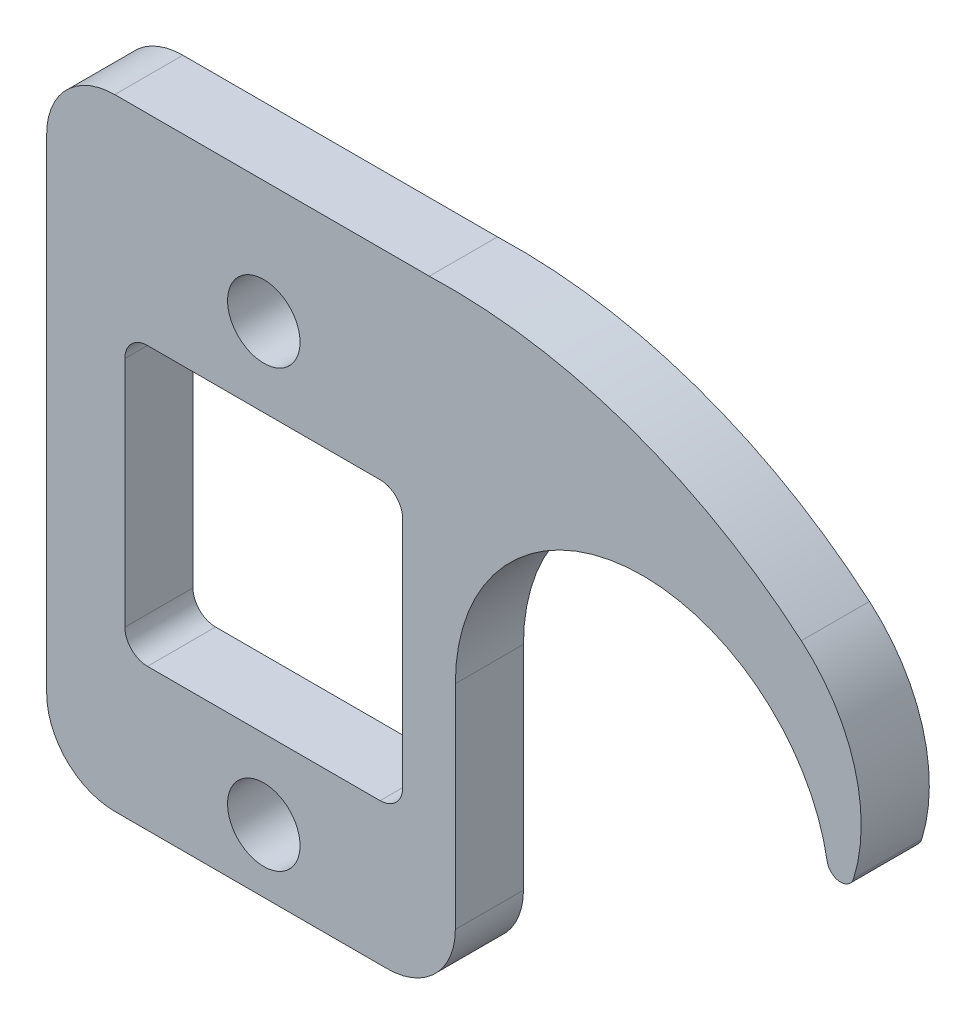
ISO-10303-21;
HEADER;
FILE_DESCRIPTION(('STEP AP214'),'2;1');
FILE_NAME('part.step','',(''),(''),'','','');
FILE_SCHEMA(('AUTOMOTIVE_DESIGN { 1 0 10303 214 1 1 1 1 }'));
ENDSEC;
DATA;
#1=APPLICATION_CONTEXT('core data for automotive mechanical design processes');
#2=APPLICATION_PROTOCOL_DEFINITION('international standard','automotive_design',2000,#1);
#3=PRODUCT_CONTEXT('',#1,'mechanical');
#4=PRODUCT('Part','Part','',(#3));
#5=PRODUCT_RELATED_PRODUCT_CATEGORY('part','',(#4));
#6=PRODUCT_DEFINITION_FORMATION('','',#4);
#7=PRODUCT_DEFINITION_CONTEXT('part definition',#1,'design');
#8=PRODUCT_DEFINITION('design','',#6,#7);
#9=PRODUCT_DEFINITION_SHAPE('','',#8);
#10=(LENGTH_UNIT() NAMED_UNIT(*) SI_UNIT(.MILLI.,.METRE.));
#11=(NAMED_UNIT(*) PLANE_ANGLE_UNIT() SI_UNIT($,.RADIAN.));
#12=(NAMED_UNIT(*) SI_UNIT($,.STERADIAN.) SOLID_ANGLE_UNIT());
#13=UNCERTAINTY_MEASURE_WITH_UNIT(LENGTH_MEASURE(1.E-05),#10,'distance_accuracy_value','');
#14=(GEOMETRIC_REPRESENTATION_CONTEXT(3) GLOBAL_UNCERTAINTY_ASSIGNED_CONTEXT((#13)) GLOBAL_UNIT_ASSIGNED_CONTEXT((#10,
#11,#12)) REPRESENTATION_CONTEXT('',''));
#15=CARTESIAN_POINT('',(0.,0.,0.));
#16=DIRECTION('',(0.,0.,1.));
#17=DIRECTION('',(1.,0.,0.));
#18=AXIS2_PLACEMENT_3D('',#15,#16,#17);
#19=CARTESIAN_POINT('',(-18.1389450946709,-19.0842207006165,3.175));
#20=DIRECTION('',(0.,0.,1.));
#21=DIRECTION('',(1.,0.,0.));
#22=AXIS2_PLACEMENT_3D('',#19,#20,#21);
#23=PLANE('',#22);
#24=CARTESIAN_POINT('',(-35.321875,-20.32,3.175));
#25=DIRECTION('',(0.,0.,1.));
#26=DIRECTION('',(1.,0.,0.));
#27=AXIS2_PLACEMENT_3D('',#24,#25,#26);
#28=CIRCLE('',#27,3.3782);
#29=CARTESIAN_POINT('',(-31.943675,-20.32,3.175));
#30=VERTEX_POINT('',#29);
#31=EDGE_CURVE('E234',#30,#30,#28,.T.);
#32=ORIENTED_EDGE('',*,*,#31,.F.);
#33=EDGE_LOOP('',(#32));
#34=FACE_BOUND('',#33,.T.);
#35=CARTESIAN_POINT('',(-18.1389450946709,-19.0842207006165,3.175));
#36=DIRECTION('',(0.,0.,1.));
#37=DIRECTION('',(1.,0.,0.));
#38=AXIS2_PLACEMENT_3D('',#35,#36,#37);
#39=CIRCLE('',#38,50.8);
#40=CARTESIAN_POINT('',(14.7930990556582,19.595495793701,3.175));
#41=VERTEX_POINT('',#40);
#42=CARTESIAN_POINT('',(-19.8857253584482,31.6857385145541,3.175));
#43=VERTEX_POINT('',#42);
#44=EDGE_CURVE('E240',#41,#43,#39,.T.);
#45=ORIENTED_EDGE('',*,*,#44,.T.);
#46=DIRECTION('',(-1.,0.,0.));
#47=VECTOR('',#46,1.);
#48=CARTESIAN_POINT('',(-19.8857253584482,31.6857385145541,3.175));
#49=LINE('',#48,#47);
#50=CARTESIAN_POINT('',(-49.2125,31.6857385145541,3.175));
#51=VERTEX_POINT('',#50);
#52=EDGE_CURVE('E243',#43,#51,#49,.T.);
#53=ORIENTED_EDGE('',*,*,#52,.T.);
#54=CARTESIAN_POINT('',(-49.2125,25.3357385145541,3.175));
#55=DIRECTION('',(0.,0.,1.));
#56=DIRECTION('',(1.,0.,0.));
#57=AXIS2_PLACEMENT_3D('',#54,#55,#56);
#58=CIRCLE('',#57,6.35);
#59=CARTESIAN_POINT('',(-55.5625,25.3357385145541,3.175));
#60=VERTEX_POINT('',#59);
#61=EDGE_CURVE('E246',#51,#60,#58,.T.);
#62=ORIENTED_EDGE('',*,*,#61,.T.);
#63=DIRECTION('',(0.,-1.,0.));
#64=VECTOR('',#63,1.);
#65=CARTESIAN_POINT('',(-55.5625,25.3357385145541,3.175));
#66=LINE('',#65,#64);
#67=CARTESIAN_POINT('',(-55.5625,-19.84375,3.175));
#68=VERTEX_POINT('',#67);
#69=EDGE_CURVE('E248',#60,#68,#66,.T.);
#70=ORIENTED_EDGE('',*,*,#69,.T.);
#71=CARTESIAN_POINT('',(-49.2125,-19.84375,3.175));
#72=DIRECTION('',(0.,0.,1.));
#73=DIRECTION('',(1.,0.,0.));
#74=AXIS2_PLACEMENT_3D('',#71,#72,#73);
#75=CIRCLE('',#74,6.35);
#76=CARTESIAN_POINT('',(-49.2125,-26.19375,3.175));
#77=VERTEX_POINT('',#76);
#78=EDGE_CURVE('E250',#68,#77,#75,.T.);
#79=ORIENTED_EDGE('',*,*,#78,.T.);
#80=DIRECTION('',(1.,0.,0.));
#81=VECTOR('',#80,1.);
#82=CARTESIAN_POINT('',(-49.2125,-26.19375,3.175));
#83=LINE('',#82,#81);
#84=CARTESIAN_POINT('',(-23.8125,-26.19375,3.175));
#85=VERTEX_POINT('',#84);
#86=EDGE_CURVE('E252',#77,#85,#83,.T.);
#87=ORIENTED_EDGE('',*,*,#86,.T.);
#88=CARTESIAN_POINT('',(-23.8125,-19.84375,3.175));
#89=DIRECTION('',(0.,0.,1.));
#90=DIRECTION('',(1.,0.,0.));
#91=AXIS2_PLACEMENT_3D('',#88,#89,#90);
#92=CIRCLE('',#91,6.35);
#93=CARTESIAN_POINT('',(-17.4625,-19.84375,3.175));
#94=VERTEX_POINT('',#93);
#95=EDGE_CURVE('E254',#85,#94,#92,.T.);
#96=ORIENTED_EDGE('',*,*,#95,.T.);
#97=DIRECTION('',(0.,1.,0.));
#98=VECTOR('',#97,1.);
#99=CARTESIAN_POINT('',(-17.4625,-19.84375,3.175));
#100=LINE('',#99,#98);
#101=CARTESIAN_POINT('',(-17.4625,-1.21864324187371E-13,3.175));
#102=VERTEX_POINT('',#101);
#103=EDGE_CURVE('E256',#94,#102,#100,.T.);
#104=ORIENTED_EDGE('',*,*,#103,.T.);
#105=CARTESIAN_POINT('',(0.,0.,3.175));
#106=DIRECTION('',(0.,0.,-1.));
#107=DIRECTION('',(1.,0.,0.));
#108=AXIS2_PLACEMENT_3D('',#105,#106,#107);
#109=CIRCLE('',#108,17.4625);
#110=CARTESIAN_POINT('',(17.205767985411,2.98336291493413,3.175));
#111=VERTEX_POINT('',#110);
#112=EDGE_CURVE('E258',#102,#111,#109,.T.);
#113=ORIENTED_EDGE('',*,*,#112,.T.);
#114=CARTESIAN_POINT('',(18.4570965661682,3.20033476329298,3.175));
#115=DIRECTION('',(0.,0.,1.));
#116=DIRECTION('',(1.,0.,0.));
#117=AXIS2_PLACEMENT_3D('',#114,#115,#116);
#118=CIRCLE('',#117,1.27);
#119=CARTESIAN_POINT('',(19.670597549428,2.82574783929873,3.175));
#120=VERTEX_POINT('',#119);
#121=EDGE_CURVE('E260',#111,#120,#118,.T.);
#122=ORIENTED_EDGE('',*,*,#121,.T.);
#123=CARTESIAN_POINT('',(4.50183525868039,7.5080843892268,3.175));
#124=DIRECTION('',(0.,0.,1.));
#125=DIRECTION('',(1.,0.,0.));
#126=AXIS2_PLACEMENT_3D('',#123,#124,#125);
#127=CIRCLE('',#126,15.875);
#128=EDGE_CURVE('E262',#120,#41,#127,.T.);
#129=ORIENTED_EDGE('',*,*,#128,.T.);
#130=EDGE_LOOP('',(#45,#53,#62,#70,#79,#87,#96,#104,#113,#122,#129));
#131=FACE_BOUND('',#130,.T.);
#132=CARTESIAN_POINT('',(-35.321875,20.32,3.175));
#133=DIRECTION('',(0.,0.,1.));
#134=DIRECTION('',(1.,0.,0.));
#135=AXIS2_PLACEMENT_3D('',#132,#133,#134);
#136=CIRCLE('',#135,3.3782);
#137=CARTESIAN_POINT('',(-31.943675,20.32,3.175));
#138=VERTEX_POINT('',#137);
#139=EDGE_CURVE('E228',#138,#138,#136,.T.);
#140=ORIENTED_EDGE('',*,*,#139,.F.);
#141=EDGE_LOOP('',(#140));
#142=FACE_BOUND('',#141,.T.);
#143=DIRECTION('',(-1.,0.,0.));
#144=VECTOR('',#143,1.);
#145=CARTESIAN_POINT('',(-24.476075,12.954,3.175));
#146=LINE('',#145,#144);
#147=CARTESIAN_POINT('',(-24.476075,12.954,3.175));
#148=VERTEX_POINT('',#147);
#149=CARTESIAN_POINT('',(-46.167675,12.954,3.175));
#150=VERTEX_POINT('',#149);
#151=EDGE_CURVE('E171',#148,#150,#146,.T.);
#152=ORIENTED_EDGE('',*,*,#151,.F.);
#153=CARTESIAN_POINT('',(-24.476075,10.8458,3.175));
#154=DIRECTION('',(0.,0.,1.));
#155=DIRECTION('',(1.,0.,0.));
#156=AXIS2_PLACEMENT_3D('',#153,#154,#155);
#157=CIRCLE('',#156,2.1082);
#158=CARTESIAN_POINT('',(-22.367875,10.8458,3.175));
#159=VERTEX_POINT('',#158);
#160=EDGE_CURVE('E163',#159,#148,#157,.T.);
#161=ORIENTED_EDGE('',*,*,#160,.F.);
#162=DIRECTION('',(0.,1.,0.));
#163=VECTOR('',#162,1.);
#164=CARTESIAN_POINT('',(-22.367875,-10.8458,3.175));
#165=LINE('',#164,#163);
#166=CARTESIAN_POINT('',(-22.367875,-10.8458,3.175));
#167=VERTEX_POINT('',#166);
#168=EDGE_CURVE('E196',#167,#159,#165,.T.);
#169=ORIENTED_EDGE('',*,*,#168,.F.);
#170=CARTESIAN_POINT('',(-24.476075,-10.8458,3.175));
#171=DIRECTION('',(0.,0.,1.));
#172=DIRECTION('',(1.,0.,0.));
#173=AXIS2_PLACEMENT_3D('',#170,#171,#172);
#174=CIRCLE('',#173,2.1082);
#175=CARTESIAN_POINT('',(-24.476075,-12.954,3.175));
#176=VERTEX_POINT('',#175);
#177=EDGE_CURVE('E194',#176,#167,#174,.T.);
#178=ORIENTED_EDGE('',*,*,#177,.F.);
#179=DIRECTION('',(1.,0.,0.));
#180=VECTOR('',#179,1.);
#181=CARTESIAN_POINT('',(-46.167675,-12.954,3.175));
#182=LINE('',#181,#180);
#183=CARTESIAN_POINT('',(-46.167675,-12.954,3.175));
#184=VERTEX_POINT('',#183);
#185=EDGE_CURVE('E192',#184,#176,#182,.T.);
#186=ORIENTED_EDGE('',*,*,#185,.F.);
#187=CARTESIAN_POINT('',(-46.167675,-10.8458,3.175));
#188=DIRECTION('',(0.,0.,1.));
#189=DIRECTION('',(1.,0.,0.));
#190=AXIS2_PLACEMENT_3D('',#187,#188,#189);
#191=CIRCLE('',#190,2.1082);
#192=CARTESIAN_POINT('',(-48.275875,-10.8458,3.175));
#193=VERTEX_POINT('',#192);
#194=EDGE_CURVE('E190',#193,#184,#191,.T.);
#195=ORIENTED_EDGE('',*,*,#194,.F.);
#196=DIRECTION('',(0.,-1.,0.));
#197=VECTOR('',#196,1.);
#198=CARTESIAN_POINT('',(-48.275875,10.8458,3.175));
#199=LINE('',#198,#197);
#200=CARTESIAN_POINT('',(-48.275875,10.8458,3.175));
#201=VERTEX_POINT('',#200);
#202=EDGE_CURVE('E186',#201,#193,#199,.T.);
#203=ORIENTED_EDGE('',*,*,#202,.F.);
#204=CARTESIAN_POINT('',(-46.167675,10.8458,3.175));
#205=DIRECTION('',(0.,0.,1.));
#206=DIRECTION('',(1.,0.,0.));
#207=AXIS2_PLACEMENT_3D('',#204,#205,#206);
#208=CIRCLE('',#207,2.1082);
#209=EDGE_CURVE('E184',#150,#201,#208,.T.);
#210=ORIENTED_EDGE('',*,*,#209,.F.);
#211=EDGE_LOOP('',(#152,#161,#169,#178,#186,#195,#203,#210));
#212=FACE_BOUND('',#211,.T.);
#213=ADVANCED_FACE('F32',(#34,#131,#142,#212),#23,.T.);
#214=CARTESIAN_POINT('',(-18.1389450946709,-19.0842207006165,-3.175));
#215=DIRECTION('',(0.,0.,1.));
#216=DIRECTION('',(1.,0.,0.));
#217=AXIS2_PLACEMENT_3D('',#214,#215,#216);
#218=PLANE('',#217);
#219=CARTESIAN_POINT('',(-35.321875,20.32,-3.175));
#220=DIRECTION('',(0.,0.,1.));
#221=DIRECTION('',(1.,0.,0.));
#222=AXIS2_PLACEMENT_3D('',#219,#220,#221);
#223=CIRCLE('',#222,3.3782);
#224=CARTESIAN_POINT('',(-31.943675,20.32,-3.175));
#225=VERTEX_POINT('',#224);
#226=EDGE_CURVE('E179',#225,#225,#223,.T.);
#227=ORIENTED_EDGE('',*,*,#226,.T.);
#228=EDGE_LOOP('',(#227));
#229=FACE_BOUND('',#228,.T.);
#230=CARTESIAN_POINT('',(-35.321875,-20.32,-3.175));
#231=DIRECTION('',(0.,0.,1.));
#232=DIRECTION('',(1.,0.,0.));
#233=AXIS2_PLACEMENT_3D('',#230,#231,#232);
#234=CIRCLE('',#233,3.3782);
#235=CARTESIAN_POINT('',(-31.943675,-20.32,-3.175));
#236=VERTEX_POINT('',#235);
#237=EDGE_CURVE('E231',#236,#236,#234,.T.);
#238=ORIENTED_EDGE('',*,*,#237,.T.);
#239=EDGE_LOOP('',(#238));
#240=FACE_BOUND('',#239,.T.);
#241=CARTESIAN_POINT('',(-18.1389450946709,-19.0842207006165,-3.175));
#242=DIRECTION('',(0.,0.,1.));
#243=DIRECTION('',(1.,0.,0.));
#244=AXIS2_PLACEMENT_3D('',#241,#242,#243);
#245=CIRCLE('',#244,50.8);
#246=CARTESIAN_POINT('',(14.7930990556582,19.595495793701,-3.175));
#247=VERTEX_POINT('',#246);
#248=CARTESIAN_POINT('',(-19.8857253584482,31.6857385145541,-3.175));
#249=VERTEX_POINT('',#248);
#250=EDGE_CURVE('E237',#247,#249,#245,.T.);
#251=ORIENTED_EDGE('',*,*,#250,.F.);
#252=CARTESIAN_POINT('',(4.50183525868039,7.5080843892268,-3.175));
#253=DIRECTION('',(0.,0.,1.));
#254=DIRECTION('',(1.,0.,0.));
#255=AXIS2_PLACEMENT_3D('',#252,#253,#254);
#256=CIRCLE('',#255,15.875);
#257=CARTESIAN_POINT('',(19.670597549428,2.82574783929873,-3.175));
#258=VERTEX_POINT('',#257);
#259=EDGE_CURVE('E244',#258,#247,#256,.T.);
#260=ORIENTED_EDGE('',*,*,#259,.F.);
#261=CARTESIAN_POINT('',(18.4570965661682,3.20033476329298,-3.175));
#262=DIRECTION('',(0.,0.,1.));
#263=DIRECTION('',(1.,0.,0.));
#264=AXIS2_PLACEMENT_3D('',#261,#262,#263);
#265=CIRCLE('',#264,1.27);
#266=CARTESIAN_POINT('',(17.205767985411,2.98336291493413,-3.175));
#267=VERTEX_POINT('',#266);
#268=EDGE_CURVE('E283',#267,#258,#265,.T.);
#269=ORIENTED_EDGE('',*,*,#268,.F.);
#270=CARTESIAN_POINT('',(0.,0.,-3.175));
#271=DIRECTION('',(0.,0.,-1.));
#272=DIRECTION('',(1.,0.,0.));
#273=AXIS2_PLACEMENT_3D('',#270,#271,#272);
#274=CIRCLE('',#273,17.4625);
#275=CARTESIAN_POINT('',(-17.4625,-1.21864324187371E-13,-3.175));
#276=VERTEX_POINT('',#275);
#277=EDGE_CURVE('E281',#276,#267,#274,.T.);
#278=ORIENTED_EDGE('',*,*,#277,.F.);
#279=DIRECTION('',(0.,1.,0.));
#280=VECTOR('',#279,1.);
#281=CARTESIAN_POINT('',(-17.4625,-19.84375,-3.175));
#282=LINE('',#281,#280);
#283=CARTESIAN_POINT('',(-17.4625,-19.84375,-3.175));
#284=VERTEX_POINT('',#283);
#285=EDGE_CURVE('E279',#284,#276,#282,.T.);
#286=ORIENTED_EDGE('',*,*,#285,.F.);
#287=CARTESIAN_POINT('',(-23.8125,-19.84375,-3.175));
#288=DIRECTION('',(0.,0.,1.));
#289=DIRECTION('',(1.,0.,0.));
#290=AXIS2_PLACEMENT_3D('',#287,#288,#289);
#291=CIRCLE('',#290,6.35);
#292=CARTESIAN_POINT('',(-23.8125,-26.19375,-3.175));
#293=VERTEX_POINT('',#292);
#294=EDGE_CURVE('E277',#293,#284,#291,.T.);
#295=ORIENTED_EDGE('',*,*,#294,.F.);
#296=DIRECTION('',(1.,0.,0.));
#297=VECTOR('',#296,1.);
#298=CARTESIAN_POINT('',(-49.2125,-26.19375,-3.175));
#299=LINE('',#298,#297);
#300=CARTESIAN_POINT('',(-49.2125,-26.19375,-3.175));
#301=VERTEX_POINT('',#300);
#302=EDGE_CURVE('E275',#301,#293,#299,.T.);
#303=ORIENTED_EDGE('',*,*,#302,.F.);
#304=CARTESIAN_POINT('',(-49.2125,-19.84375,-3.175));
#305=DIRECTION('',(0.,0.,1.));
#306=DIRECTION('',(1.,0.,0.));
#307=AXIS2_PLACEMENT_3D('',#304,#305,#306);
#308=CIRCLE('',#307,6.35);
#309=CARTESIAN_POINT('',(-55.5625,-19.84375,-3.175));
#310=VERTEX_POINT('',#309);
#311=EDGE_CURVE('E273',#310,#301,#308,.T.);
#312=ORIENTED_EDGE('',*,*,#311,.F.);
#313=DIRECTION('',(0.,-1.,0.));
#314=VECTOR('',#313,1.);
#315=CARTESIAN_POINT('',(-55.5625,25.3357385145541,-3.175));
#316=LINE('',#315,#314);
#317=CARTESIAN_POINT('',(-55.5625,25.3357385145541,-3.175));
#318=VERTEX_POINT('',#317);
#319=EDGE_CURVE('E271',#318,#310,#316,.T.);
#320=ORIENTED_EDGE('',*,*,#319,.F.);
#321=CARTESIAN_POINT('',(-49.2125,25.3357385145541,-3.175));
#322=DIRECTION('',(0.,0.,1.));
#323=DIRECTION('',(1.,0.,0.));
#324=AXIS2_PLACEMENT_3D('',#321,#322,#323);
#325=CIRCLE('',#324,6.35);
#326=CARTESIAN_POINT('',(-49.2125,31.6857385145541,-3.175));
#327=VERTEX_POINT('',#326);
#328=EDGE_CURVE('E269',#327,#318,#325,.T.);
#329=ORIENTED_EDGE('',*,*,#328,.F.);
#330=DIRECTION('',(-1.,0.,0.));
#331=VECTOR('',#330,1.);
#332=CARTESIAN_POINT('',(-19.8857253584482,31.6857385145541,-3.175));
#333=LINE('',#332,#331);
#334=EDGE_CURVE('E267',#249,#327,#333,.T.);
#335=ORIENTED_EDGE('',*,*,#334,.F.);
#336=EDGE_LOOP('',(#251,#260,#269,#278,#286,#295,#303,#312,#320,#329,#335));
#337=FACE_BOUND('',#336,.T.);
#338=CARTESIAN_POINT('',(-24.476075,10.8458,-3.175));
#339=DIRECTION('',(0.,0.,1.));
#340=DIRECTION('',(1.,0.,0.));
#341=AXIS2_PLACEMENT_3D('',#338,#339,#340);
#342=CIRCLE('',#341,2.1082);
#343=CARTESIAN_POINT('',(-22.367875,10.8458,-3.175));
#344=VERTEX_POINT('',#343);
#345=CARTESIAN_POINT('',(-24.476075,12.954,-3.175));
#346=VERTEX_POINT('',#345);
#347=EDGE_CURVE('E55',#344,#346,#342,.T.);
#348=ORIENTED_EDGE('',*,*,#347,.T.);
#349=DIRECTION('',(-1.,0.,0.));
#350=VECTOR('',#349,1.);
#351=CARTESIAN_POINT('',(-24.476075,12.954,-3.175));
#352=LINE('',#351,#350);
#353=CARTESIAN_POINT('',(-46.167675,12.954,-3.175));
#354=VERTEX_POINT('',#353);
#355=EDGE_CURVE('E178',#346,#354,#352,.T.);
#356=ORIENTED_EDGE('',*,*,#355,.T.);
#357=CARTESIAN_POINT('',(-46.167675,10.8458,-3.175));
#358=DIRECTION('',(0.,0.,1.));
#359=DIRECTION('',(1.,0.,0.));
#360=AXIS2_PLACEMENT_3D('',#357,#358,#359);
#361=CIRCLE('',#360,2.1082);
#362=CARTESIAN_POINT('',(-48.275875,10.8458,-3.175));
#363=VERTEX_POINT('',#362);
#364=EDGE_CURVE('E200',#354,#363,#361,.T.);
#365=ORIENTED_EDGE('',*,*,#364,.T.);
#366=DIRECTION('',(0.,-1.,0.));
#367=VECTOR('',#366,1.);
#368=CARTESIAN_POINT('',(-48.275875,10.8458,-3.175));
#369=LINE('',#368,#367);
#370=CARTESIAN_POINT('',(-48.275875,-10.8458,-3.175));
#371=VERTEX_POINT('',#370);
#372=EDGE_CURVE('E203',#363,#371,#369,.T.);
#373=ORIENTED_EDGE('',*,*,#372,.T.);
#374=CARTESIAN_POINT('',(-46.167675,-10.8458,-3.175));
#375=DIRECTION('',(0.,0.,1.));
#376=DIRECTION('',(1.,0.,0.));
#377=AXIS2_PLACEMENT_3D('',#374,#375,#376);
#378=CIRCLE('',#377,2.1082);
#379=CARTESIAN_POINT('',(-46.167675,-12.954,-3.175));
#380=VERTEX_POINT('',#379);
#381=EDGE_CURVE('E206',#371,#380,#378,.T.);
#382=ORIENTED_EDGE('',*,*,#381,.T.);
#383=DIRECTION('',(1.,0.,0.));
#384=VECTOR('',#383,1.);
#385=CARTESIAN_POINT('',(-46.167675,-12.954,-3.175));
#386=LINE('',#385,#384);
#387=CARTESIAN_POINT('',(-24.476075,-12.954,-3.175));
#388=VERTEX_POINT('',#387);
#389=EDGE_CURVE('E209',#380,#388,#386,.T.);
#390=ORIENTED_EDGE('',*,*,#389,.T.);
#391=CARTESIAN_POINT('',(-24.476075,-10.8458,-3.175));
#392=DIRECTION('',(0.,0.,1.));
#393=DIRECTION('',(1.,0.,0.));
#394=AXIS2_PLACEMENT_3D('',#391,#392,#393);
#395=CIRCLE('',#394,2.1082);
#396=CARTESIAN_POINT('',(-22.367875,-10.8458,-3.175));
#397=VERTEX_POINT('',#396);
#398=EDGE_CURVE('E212',#388,#397,#395,.T.);
#399=ORIENTED_EDGE('',*,*,#398,.T.);
#400=DIRECTION('',(0.,1.,0.));
#401=VECTOR('',#400,1.);
#402=CARTESIAN_POINT('',(-22.367875,-10.8458,-3.175));
#403=LINE('',#402,#401);
#404=EDGE_CURVE('E172',#397,#344,#403,.T.);
#405=ORIENTED_EDGE('',*,*,#404,.T.);
#406=EDGE_LOOP('',(#348,#356,#365,#373,#382,#390,#399,#405));
#407=FACE_BOUND('',#406,.T.);
#408=ADVANCED_FACE('F322',(#229,#240,#337,#407),#218,.F.);
#409=CARTESIAN_POINT('',(-18.1389450946709,-19.0842207006165,3.175));
#410=DIRECTION('',(0.,0.,-1.));
#411=DIRECTION('',(-1.,0.,0.));
#412=AXIS2_PLACEMENT_3D('',#409,#410,#411);
#413=CYLINDRICAL_SURFACE('',#412,50.8);
#414=ORIENTED_EDGE('',*,*,#250,.T.);
#415=DIRECTION('',(0.,0.,-1.));
#416=VECTOR('',#415,1.);
#417=CARTESIAN_POINT('',(-19.8857253584482,31.6857385145541,3.175));
#418=LINE('',#417,#416);
#419=EDGE_CURVE('E11',#43,#249,#418,.T.);
#420=ORIENTED_EDGE('',*,*,#419,.F.);
#421=ORIENTED_EDGE('',*,*,#44,.F.);
#422=DIRECTION('',(0.,0.,-1.));
#423=VECTOR('',#422,1.);
#424=CARTESIAN_POINT('',(14.7930990556582,19.595495793701,3.175));
#425=LINE('',#424,#423);
#426=EDGE_CURVE('E264',#41,#247,#425,.T.);
#427=ORIENTED_EDGE('',*,*,#426,.T.);
#428=EDGE_LOOP('',(#414,#420,#421,#427));
#429=FACE_BOUND('',#428,.T.);
#430=ADVANCED_FACE('F34',(#429),#413,.T.);
#431=CARTESIAN_POINT('',(-19.8857253584482,31.6857385145541,3.175));
#432=DIRECTION('',(0.,-1.,0.));
#433=DIRECTION('',(1.,0.,0.));
#434=AXIS2_PLACEMENT_3D('',#431,#432,#433);
#435=PLANE('',#434);
#436=ORIENTED_EDGE('',*,*,#334,.T.);
#437=DIRECTION('',(0.,0.,-1.));
#438=VECTOR('',#437,1.);
#439=CARTESIAN_POINT('',(-49.2125,31.6857385145541,3.175));
#440=LINE('',#439,#438);
#441=EDGE_CURVE('E40',#51,#327,#440,.T.);
#442=ORIENTED_EDGE('',*,*,#441,.F.);
#443=ORIENTED_EDGE('',*,*,#52,.F.);
#444=ORIENTED_EDGE('',*,*,#419,.T.);
#445=EDGE_LOOP('',(#436,#442,#443,#444));
#446=FACE_BOUND('',#445,.T.);
#447=ADVANCED_FACE('F340',(#446),#435,.F.);
#448=CARTESIAN_POINT('',(-49.2125,25.3357385145541,3.175));
#449=DIRECTION('',(0.,0.,-1.));
#450=DIRECTION('',(-1.,0.,0.));
#451=AXIS2_PLACEMENT_3D('',#448,#449,#450);
#452=CYLINDRICAL_SURFACE('',#451,6.35);
#453=ORIENTED_EDGE('',*,*,#328,.T.);
#454=DIRECTION('',(0.,0.,-1.));
#455=VECTOR('',#454,1.);
#456=CARTESIAN_POINT('',(-55.5625,25.3357385145541,3.175));
#457=LINE('',#456,#455);
#458=EDGE_CURVE('E309',#60,#318,#457,.T.);
#459=ORIENTED_EDGE('',*,*,#458,.F.);
#460=ORIENTED_EDGE('',*,*,#61,.F.);
#461=ORIENTED_EDGE('',*,*,#441,.T.);
#462=EDGE_LOOP('',(#453,#459,#460,#461));
#463=FACE_BOUND('',#462,.T.);
#464=ADVANCED_FACE('F316',(#463),#452,.T.);
#465=CARTESIAN_POINT('',(-55.5625,25.3357385145541,3.175));
#466=DIRECTION('',(1.,0.,0.));
#467=DIRECTION('',(0.,1.,0.));
#468=AXIS2_PLACEMENT_3D('',#465,#466,#467);
#469=PLANE('',#468);
#470=ORIENTED_EDGE('',*,*,#319,.T.);
#471=DIRECTION('',(0.,0.,-1.));
#472=VECTOR('',#471,1.);
#473=CARTESIAN_POINT('',(-55.5625,-19.84375,3.175));
#474=LINE('',#473,#472);
#475=EDGE_CURVE('E306',#68,#310,#474,.T.);
#476=ORIENTED_EDGE('',*,*,#475,.F.);
#477=ORIENTED_EDGE('',*,*,#69,.F.);
#478=ORIENTED_EDGE('',*,*,#458,.T.);
#479=EDGE_LOOP('',(#470,#476,#477,#478));
#480=FACE_BOUND('',#479,.T.);
#481=ADVANCED_FACE('F328',(#480),#469,.F.);
#482=CARTESIAN_POINT('',(-49.2125,-19.84375,3.175));
#483=DIRECTION('',(0.,0.,-1.));
#484=DIRECTION('',(-1.,0.,0.));
#485=AXIS2_PLACEMENT_3D('',#482,#483,#484);
#486=CYLINDRICAL_SURFACE('',#485,6.35);
#487=ORIENTED_EDGE('',*,*,#311,.T.);
#488=DIRECTION('',(0.,0.,-1.));
#489=VECTOR('',#488,1.);
#490=CARTESIAN_POINT('',(-49.2125,-26.19375,3.175));
#491=LINE('',#490,#489);
#492=EDGE_CURVE('E303',#77,#301,#491,.T.);
#493=ORIENTED_EDGE('',*,*,#492,.F.);
#494=ORIENTED_EDGE('',*,*,#78,.F.);
#495=ORIENTED_EDGE('',*,*,#475,.T.);
#496=EDGE_LOOP('',(#487,#493,#494,#495));
#497=FACE_BOUND('',#496,.T.);
#498=ADVANCED_FACE('F332',(#497),#486,.T.);
#499=CARTESIAN_POINT('',(-49.2125,-26.19375,3.175));
#500=DIRECTION('',(0.,1.,0.));
#501=DIRECTION('',(0.,0.,1.));
#502=AXIS2_PLACEMENT_3D('',#499,#500,#501);
#503=PLANE('',#502);
#504=ORIENTED_EDGE('',*,*,#302,.T.);
#505=DIRECTION('',(0.,0.,-1.));
#506=VECTOR('',#505,1.);
#507=CARTESIAN_POINT('',(-23.8125,-26.19375,3.175));
#508=LINE('',#507,#506);
#509=EDGE_CURVE('E300',#85,#293,#508,.T.);
#510=ORIENTED_EDGE('',*,*,#509,.F.);
#511=ORIENTED_EDGE('',*,*,#86,.F.);
#512=ORIENTED_EDGE('',*,*,#492,.T.);
#513=EDGE_LOOP('',(#504,#510,#511,#512));
#514=FACE_BOUND('',#513,.T.);
#515=ADVANCED_FACE('F368',(#514),#503,.F.);
#516=CARTESIAN_POINT('',(-23.8125,-19.84375,3.175));
#517=DIRECTION('',(0.,0.,-1.));
#518=DIRECTION('',(-1.,0.,0.));
#519=AXIS2_PLACEMENT_3D('',#516,#517,#518);
#520=CYLINDRICAL_SURFACE('',#519,6.35);
#521=ORIENTED_EDGE('',*,*,#294,.T.);
#522=DIRECTION('',(0.,0.,-1.));
#523=VECTOR('',#522,1.);
#524=CARTESIAN_POINT('',(-17.4625,-19.84375,3.175));
#525=LINE('',#524,#523);
#526=EDGE_CURVE('E297',#94,#284,#525,.T.);
#527=ORIENTED_EDGE('',*,*,#526,.F.);
#528=ORIENTED_EDGE('',*,*,#95,.F.);
#529=ORIENTED_EDGE('',*,*,#509,.T.);
#530=EDGE_LOOP('',(#521,#527,#528,#529));
#531=FACE_BOUND('',#530,.T.);
#532=ADVANCED_FACE('F366',(#531),#520,.T.);
#533=CARTESIAN_POINT('',(-17.4625,-19.84375,3.175));
#534=DIRECTION('',(-1.,0.,0.));
#535=DIRECTION('',(0.,0.,1.));
#536=AXIS2_PLACEMENT_3D('',#533,#534,#535);
#537=PLANE('',#536);
#538=ORIENTED_EDGE('',*,*,#285,.T.);
#539=DIRECTION('',(0.,0.,-1.));
#540=VECTOR('',#539,1.);
#541=CARTESIAN_POINT('',(-17.4625,-1.21864324187371E-13,3.175));
#542=LINE('',#541,#540);
#543=EDGE_CURVE('E294',#102,#276,#542,.T.);
#544=ORIENTED_EDGE('',*,*,#543,.F.);
#545=ORIENTED_EDGE('',*,*,#103,.F.);
#546=ORIENTED_EDGE('',*,*,#526,.T.);
#547=EDGE_LOOP('',(#538,#544,#545,#546));
#548=FACE_BOUND('',#547,.T.);
#549=ADVANCED_FACE('F361',(#548),#537,.F.);
#550=CARTESIAN_POINT('',(0.,0.,3.175));
#551=DIRECTION('',(0.,0.,-1.));
#552=DIRECTION('',(-1.,0.,0.));
#553=AXIS2_PLACEMENT_3D('',#550,#551,#552);
#554=CYLINDRICAL_SURFACE('',#553,17.4625);
#555=ORIENTED_EDGE('',*,*,#277,.T.);
#556=DIRECTION('',(0.,0.,-1.));
#557=VECTOR('',#556,1.);
#558=CARTESIAN_POINT('',(17.205767985411,2.98336291493413,3.175));
#559=LINE('',#558,#557);
#560=EDGE_CURVE('E291',#111,#267,#559,.T.);
#561=ORIENTED_EDGE('',*,*,#560,.F.);
#562=ORIENTED_EDGE('',*,*,#112,.F.);
#563=ORIENTED_EDGE('',*,*,#543,.T.);
#564=EDGE_LOOP('',(#555,#561,#562,#563));
#565=FACE_BOUND('',#564,.T.);
#566=ADVANCED_FACE('F356',(#565),#554,.F.);
#567=CARTESIAN_POINT('',(18.4570965661682,3.20033476329298,3.175));
#568=DIRECTION('',(0.,0.,-1.));
#569=DIRECTION('',(-1.,0.,0.));
#570=AXIS2_PLACEMENT_3D('',#567,#568,#569);
#571=CYLINDRICAL_SURFACE('',#570,1.27);
#572=ORIENTED_EDGE('',*,*,#268,.T.);
#573=DIRECTION('',(0.,0.,-1.));
#574=VECTOR('',#573,1.);
#575=CARTESIAN_POINT('',(19.670597549428,2.82574783929873,3.175));
#576=LINE('',#575,#574);
#577=EDGE_CURVE('E288',#120,#258,#576,.T.);
#578=ORIENTED_EDGE('',*,*,#577,.F.);
#579=ORIENTED_EDGE('',*,*,#121,.F.);
#580=ORIENTED_EDGE('',*,*,#560,.T.);
#581=EDGE_LOOP('',(#572,#578,#579,#580));
#582=FACE_BOUND('',#581,.T.);
#583=ADVANCED_FACE('F352',(#582),#571,.T.);
#584=CARTESIAN_POINT('',(4.50183525868039,7.5080843892268,3.175));
#585=DIRECTION('',(0.,0.,-1.));
#586=DIRECTION('',(-1.,0.,0.));
#587=AXIS2_PLACEMENT_3D('',#584,#585,#586);
#588=CYLINDRICAL_SURFACE('',#587,15.875);
#589=ORIENTED_EDGE('',*,*,#259,.T.);
#590=ORIENTED_EDGE('',*,*,#426,.F.);
#591=ORIENTED_EDGE('',*,*,#128,.F.);
#592=ORIENTED_EDGE('',*,*,#577,.T.);
#593=EDGE_LOOP('',(#589,#590,#591,#592));
#594=FACE_BOUND('',#593,.T.);
#595=ADVANCED_FACE('F347',(#594),#588,.T.);
#596=CARTESIAN_POINT('',(-35.321875,-20.32,3.175));
#597=DIRECTION('',(0.,0.,-1.));
#598=DIRECTION('',(-1.,0.,0.));
#599=AXIS2_PLACEMENT_3D('',#596,#597,#598);
#600=CYLINDRICAL_SURFACE('',#599,3.3782);
#601=ORIENTED_EDGE('',*,*,#31,.T.);
#602=EDGE_LOOP('',(#601));
#603=FACE_BOUND('',#602,.T.);
#604=ORIENTED_EDGE('',*,*,#237,.F.);
#605=EDGE_LOOP('',(#604));
#606=FACE_BOUND('',#605,.T.);
#607=ADVANCED_FACE('F387',(#603,#606),#600,.F.);
#608=CARTESIAN_POINT('',(-35.321875,20.32,3.175));
#609=DIRECTION('',(0.,0.,-1.));
#610=DIRECTION('',(-1.,0.,0.));
#611=AXIS2_PLACEMENT_3D('',#608,#609,#610);
#612=CYLINDRICAL_SURFACE('',#611,3.3782);
#613=ORIENTED_EDGE('',*,*,#139,.T.);
#614=EDGE_LOOP('',(#613));
#615=FACE_BOUND('',#614,.T.);
#616=ORIENTED_EDGE('',*,*,#226,.F.);
#617=EDGE_LOOP('',(#616));
#618=FACE_BOUND('',#617,.T.);
#619=ADVANCED_FACE('F419',(#615,#618),#612,.F.);
#620=CARTESIAN_POINT('',(-24.476075,10.8458,3.175));
#621=DIRECTION('',(0.,0.,-1.));
#622=DIRECTION('',(-1.,0.,0.));
#623=AXIS2_PLACEMENT_3D('',#620,#621,#622);
#624=CYLINDRICAL_SURFACE('',#623,2.1082);
#625=ORIENTED_EDGE('',*,*,#347,.F.);
#626=DIRECTION('',(0.,0.,-1.));
#627=VECTOR('',#626,1.);
#628=CARTESIAN_POINT('',(-22.367875,10.8458,3.175));
#629=LINE('',#628,#627);
#630=EDGE_CURVE('E167',#159,#344,#629,.T.);
#631=ORIENTED_EDGE('',*,*,#630,.F.);
#632=ORIENTED_EDGE('',*,*,#160,.T.);
#633=DIRECTION('',(0.,0.,-1.));
#634=VECTOR('',#633,1.);
#635=CARTESIAN_POINT('',(-24.476075,12.954,3.175));
#636=LINE('',#635,#634);
#637=EDGE_CURVE('E166',#148,#346,#636,.T.);
#638=ORIENTED_EDGE('',*,*,#637,.T.);
#639=EDGE_LOOP('',(#625,#631,#632,#638));
#640=FACE_BOUND('',#639,.T.);
#641=ADVANCED_FACE('F165',(#640),#624,.F.);
#642=CARTESIAN_POINT('',(-24.476075,12.954,3.175));
#643=DIRECTION('',(0.,-1.,0.));
#644=DIRECTION('',(0.,0.,-1.));
#645=AXIS2_PLACEMENT_3D('',#642,#643,#644);
#646=PLANE('',#645);
#647=ORIENTED_EDGE('',*,*,#355,.F.);
#648=ORIENTED_EDGE('',*,*,#637,.F.);
#649=ORIENTED_EDGE('',*,*,#151,.T.);
#650=DIRECTION('',(0.,0.,-1.));
#651=VECTOR('',#650,1.);
#652=CARTESIAN_POINT('',(-46.167675,12.954,3.175));
#653=LINE('',#652,#651);
#654=EDGE_CURVE('E180',#150,#354,#653,.T.);
#655=ORIENTED_EDGE('',*,*,#654,.T.);
#656=EDGE_LOOP('',(#647,#648,#649,#655));
#657=FACE_BOUND('',#656,.T.);
#658=ADVANCED_FACE('F175',(#657),#646,.T.);
#659=CARTESIAN_POINT('',(-46.167675,10.8458,3.175));
#660=DIRECTION('',(0.,0.,-1.));
#661=DIRECTION('',(-1.,0.,0.));
#662=AXIS2_PLACEMENT_3D('',#659,#660,#661);
#663=CYLINDRICAL_SURFACE('',#662,2.1082);
#664=ORIENTED_EDGE('',*,*,#364,.F.);
#665=ORIENTED_EDGE('',*,*,#654,.F.);
#666=ORIENTED_EDGE('',*,*,#209,.T.);
#667=DIRECTION('',(0.,0.,-1.));
#668=VECTOR('',#667,1.);
#669=CARTESIAN_POINT('',(-48.275875,10.8458,3.175));
#670=LINE('',#669,#668);
#671=EDGE_CURVE('E225',#201,#363,#670,.T.);
#672=ORIENTED_EDGE('',*,*,#671,.T.);
#673=EDGE_LOOP('',(#664,#665,#666,#672));
#674=FACE_BOUND('',#673,.T.);
#675=ADVANCED_FACE('F438',(#674),#663,.F.);
#676=CARTESIAN_POINT('',(-48.275875,10.8458,3.175));
#677=DIRECTION('',(1.,0.,0.));
#678=DIRECTION('',(0.,0.,-1.));
#679=AXIS2_PLACEMENT_3D('',#676,#677,#678);
#680=PLANE('',#679);
#681=ORIENTED_EDGE('',*,*,#372,.F.);
#682=ORIENTED_EDGE('',*,*,#671,.F.);
#683=ORIENTED_EDGE('',*,*,#202,.T.);
#684=DIRECTION('',(0.,0.,-1.));
#685=VECTOR('',#684,1.);
#686=CARTESIAN_POINT('',(-48.275875,-10.8458,3.175));
#687=LINE('',#686,#685);
#688=EDGE_CURVE('E223',#193,#371,#687,.T.);
#689=ORIENTED_EDGE('',*,*,#688,.T.);
#690=EDGE_LOOP('',(#681,#682,#683,#689));
#691=FACE_BOUND('',#690,.T.);
#692=ADVANCED_FACE('F445',(#691),#680,.T.);
#693=CARTESIAN_POINT('',(-46.167675,-10.8458,3.175));
#694=DIRECTION('',(0.,0.,-1.));
#695=DIRECTION('',(-1.,0.,0.));
#696=AXIS2_PLACEMENT_3D('',#693,#694,#695);
#697=CYLINDRICAL_SURFACE('',#696,2.1082);
#698=ORIENTED_EDGE('',*,*,#381,.F.);
#699=ORIENTED_EDGE('',*,*,#688,.F.);
#700=ORIENTED_EDGE('',*,*,#194,.T.);
#701=DIRECTION('',(0.,0.,-1.));
#702=VECTOR('',#701,1.);
#703=CARTESIAN_POINT('',(-46.167675,-12.954,3.175));
#704=LINE('',#703,#702);
#705=EDGE_CURVE('E221',#184,#380,#704,.T.);
#706=ORIENTED_EDGE('',*,*,#705,.T.);
#707=EDGE_LOOP('',(#698,#699,#700,#706));
#708=FACE_BOUND('',#707,.T.);
#709=ADVANCED_FACE('F453',(#708),#697,.F.);
#710=CARTESIAN_POINT('',(-46.167675,-12.954,3.175));
#711=DIRECTION('',(0.,1.,0.));
#712=DIRECTION('',(0.,0.,1.));
#713=AXIS2_PLACEMENT_3D('',#710,#711,#712);
#714=PLANE('',#713);
#715=ORIENTED_EDGE('',*,*,#389,.F.);
#716=ORIENTED_EDGE('',*,*,#705,.F.);
#717=ORIENTED_EDGE('',*,*,#185,.T.);
#718=DIRECTION('',(0.,0.,-1.));
#719=VECTOR('',#718,1.);
#720=CARTESIAN_POINT('',(-24.476075,-12.954,3.175));
#721=LINE('',#720,#719);
#722=EDGE_CURVE('E219',#176,#388,#721,.T.);
#723=ORIENTED_EDGE('',*,*,#722,.T.);
#724=EDGE_LOOP('',(#715,#716,#717,#723));
#725=FACE_BOUND('',#724,.T.);
#726=ADVANCED_FACE('F461',(#725),#714,.T.);
#727=CARTESIAN_POINT('',(-24.476075,-10.8458,3.175));
#728=DIRECTION('',(0.,0.,-1.));
#729=DIRECTION('',(-1.,0.,0.));
#730=AXIS2_PLACEMENT_3D('',#727,#728,#729);
#731=CYLINDRICAL_SURFACE('',#730,2.1082);
#732=ORIENTED_EDGE('',*,*,#398,.F.);
#733=ORIENTED_EDGE('',*,*,#722,.F.);
#734=ORIENTED_EDGE('',*,*,#177,.T.);
#735=DIRECTION('',(0.,0.,-1.));
#736=VECTOR('',#735,1.);
#737=CARTESIAN_POINT('',(-22.367875,-10.8458,3.175));
#738=LINE('',#737,#736);
#739=EDGE_CURVE('E47',#167,#397,#738,.T.);
#740=ORIENTED_EDGE('',*,*,#739,.T.);
#741=EDGE_LOOP('',(#732,#733,#734,#740));
#742=FACE_BOUND('',#741,.T.);
#743=ADVANCED_FACE('F469',(#742),#731,.F.);
#744=CARTESIAN_POINT('',(-22.367875,-10.8458,3.175));
#745=DIRECTION('',(-1.,0.,0.));
#746=DIRECTION('',(0.,0.,1.));
#747=AXIS2_PLACEMENT_3D('',#744,#745,#746);
#748=PLANE('',#747);
#749=ORIENTED_EDGE('',*,*,#404,.F.);
#750=ORIENTED_EDGE('',*,*,#739,.F.);
#751=ORIENTED_EDGE('',*,*,#168,.T.);
#752=ORIENTED_EDGE('',*,*,#630,.T.);
#753=EDGE_LOOP('',(#749,#750,#751,#752));
#754=FACE_BOUND('',#753,.T.);
#755=ADVANCED_FACE('F477',(#754),#748,.T.);
#756=CLOSED_SHELL('',(#213,#408,#430,#447,#464,#481,#498,#515,#532,#549,#566,#583,#595,#607,
#619,#641,#658,#675,#692,#709,#726,#743,#755));
#757=MANIFOLD_SOLID_BREP('B2',#756);
#758=ADVANCED_BREP_SHAPE_REPRESENTATION('',(#18,#757),#14);
#759=SHAPE_DEFINITION_REPRESENTATION(#9,#758);
ENDSEC;
END-ISO-10303-21;
